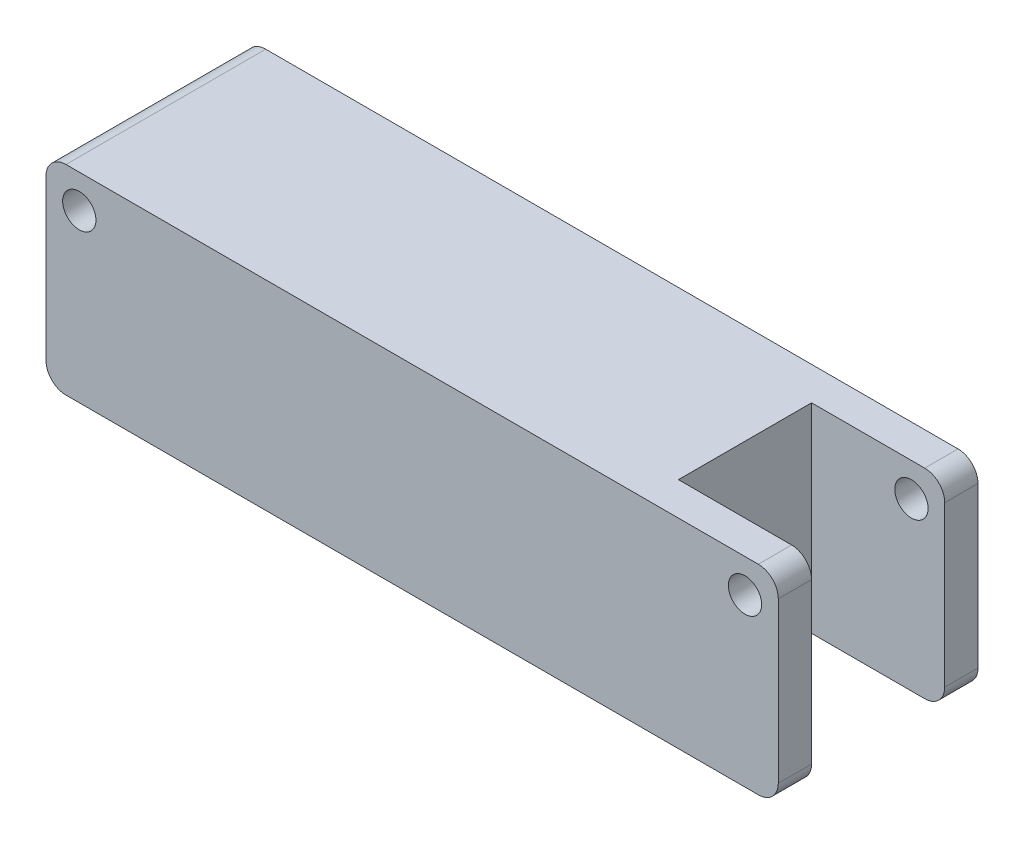
ISO-10303-21;
HEADER;
FILE_DESCRIPTION(('STEP AP214'),'2;1');
FILE_NAME('part.step','',(''),(''),'','','');
FILE_SCHEMA(('AUTOMOTIVE_DESIGN { 1 0 10303 214 1 1 1 1 }'));
ENDSEC;
DATA;
#1=APPLICATION_CONTEXT('core data for automotive mechanical design processes');
#2=APPLICATION_PROTOCOL_DEFINITION('international standard','automotive_design',2000,#1);
#3=PRODUCT_CONTEXT('',#1,'mechanical');
#4=PRODUCT('Part','Part','',(#3));
#5=PRODUCT_RELATED_PRODUCT_CATEGORY('part','',(#4));
#6=PRODUCT_DEFINITION_FORMATION('','',#4);
#7=PRODUCT_DEFINITION_CONTEXT('part definition',#1,'design');
#8=PRODUCT_DEFINITION('design','',#6,#7);
#9=PRODUCT_DEFINITION_SHAPE('','',#8);
#10=(LENGTH_UNIT() NAMED_UNIT(*) SI_UNIT(.MILLI.,.METRE.));
#11=(NAMED_UNIT(*) PLANE_ANGLE_UNIT() SI_UNIT($,.RADIAN.));
#12=(NAMED_UNIT(*) SI_UNIT($,.STERADIAN.) SOLID_ANGLE_UNIT());
#13=UNCERTAINTY_MEASURE_WITH_UNIT(LENGTH_MEASURE(1.E-05),#10,'distance_accuracy_value','');
#14=(GEOMETRIC_REPRESENTATION_CONTEXT(3) GLOBAL_UNCERTAINTY_ASSIGNED_CONTEXT((#13)) GLOBAL_UNIT_ASSIGNED_CONTEXT((#10,
#11,#12)) REPRESENTATION_CONTEXT('',''));
#15=CARTESIAN_POINT('',(0.,0.,0.));
#16=DIRECTION('',(0.,0.,1.));
#17=DIRECTION('',(1.,0.,0.));
#18=AXIS2_PLACEMENT_3D('',#15,#16,#17);
#19=CARTESIAN_POINT('',(110.,15.,15.));
#20=DIRECTION('',(-1.,0.,0.));
#21=DIRECTION('',(0.,0.,1.));
#22=AXIS2_PLACEMENT_3D('',#19,#20,#21);
#23=PLANE('',#22);
#24=DIRECTION('',(0.,0.,-1.));
#25=VECTOR('',#24,1.);
#26=CARTESIAN_POINT('',(110.,12.,15.));
#27=LINE('',#26,#25);
#28=CARTESIAN_POINT('',(110.,12.,-15.));
#29=VERTEX_POINT('',#28);
#30=CARTESIAN_POINT('',(110.,12.,-9.99999999999999));
#31=VERTEX_POINT('',#30);
#32=EDGE_CURVE('E226',#29,#31,#27,.F.);
#33=ORIENTED_EDGE('',*,*,#32,.T.);
#34=DIRECTION('',(0.,1.,0.));
#35=VECTOR('',#34,1.);
#36=CARTESIAN_POINT('',(110.,-15.,-9.99999999999999));
#37=LINE('',#36,#35);
#38=CARTESIAN_POINT('',(110.,-12.,-9.99999999999999));
#39=VERTEX_POINT('',#38);
#40=EDGE_CURVE('E174',#39,#31,#37,.T.);
#41=ORIENTED_EDGE('',*,*,#40,.F.);
#42=DIRECTION('',(0.,0.,-1.));
#43=VECTOR('',#42,1.);
#44=CARTESIAN_POINT('',(110.,-12.,-15.));
#45=LINE('',#44,#43);
#46=CARTESIAN_POINT('',(110.,-12.,-15.));
#47=VERTEX_POINT('',#46);
#48=EDGE_CURVE('E221',#39,#47,#45,.T.);
#49=ORIENTED_EDGE('',*,*,#48,.T.);
#50=DIRECTION('',(0.,-1.,0.));
#51=VECTOR('',#50,1.);
#52=CARTESIAN_POINT('',(110.,15.,-15.));
#53=LINE('',#52,#51);
#54=EDGE_CURVE('E197',#29,#47,#53,.T.);
#55=ORIENTED_EDGE('',*,*,#54,.F.);
#56=EDGE_LOOP('',(#33,#41,#49,#55));
#57=FACE_BOUND('',#56,.T.);
#58=ADVANCED_FACE('F36',(#57),#23,.F.);
#59=CARTESIAN_POINT('',(107.,12.,0.));
#60=DIRECTION('',(0.,0.,-1.));
#61=DIRECTION('',(-1.,0.,0.));
#62=AXIS2_PLACEMENT_3D('',#59,#60,#61);
#63=CYLINDRICAL_SURFACE('',#62,3.);
#64=CARTESIAN_POINT('',(107.,12.,-9.99999999999999));
#65=DIRECTION('',(0.,0.,-1.));
#66=DIRECTION('',(-1.,0.,0.));
#67=AXIS2_PLACEMENT_3D('',#64,#65,#66);
#68=CIRCLE('',#67,3.);
#69=CARTESIAN_POINT('',(107.,15.,-9.99999999999999));
#70=VERTEX_POINT('',#69);
#71=EDGE_CURVE('E180',#31,#70,#68,.F.);
#72=ORIENTED_EDGE('',*,*,#71,.F.);
#73=ORIENTED_EDGE('',*,*,#32,.F.);
#74=CARTESIAN_POINT('',(107.,12.,-15.));
#75=DIRECTION('',(0.,0.,1.));
#76=DIRECTION('',(1.,0.,0.));
#77=AXIS2_PLACEMENT_3D('',#74,#75,#76);
#78=CIRCLE('',#77,3.);
#79=CARTESIAN_POINT('',(107.,15.,-15.));
#80=VERTEX_POINT('',#79);
#81=EDGE_CURVE('E219',#80,#29,#78,.F.);
#82=ORIENTED_EDGE('',*,*,#81,.F.);
#83=DIRECTION('',(0.,0.,-1.));
#84=VECTOR('',#83,1.);
#85=CARTESIAN_POINT('',(107.,15.,0.));
#86=LINE('',#85,#84);
#87=EDGE_CURVE('E209',#70,#80,#86,.T.);
#88=ORIENTED_EDGE('',*,*,#87,.F.);
#89=EDGE_LOOP('',(#72,#73,#82,#88));
#90=FACE_BOUND('',#89,.T.);
#91=ADVANCED_FACE('F290',(#90),#63,.T.);
#92=CARTESIAN_POINT('',(107.,-12.,15.));
#93=DIRECTION('',(0.,0.,1.));
#94=DIRECTION('',(1.,0.,0.));
#95=AXIS2_PLACEMENT_3D('',#92,#93,#94);
#96=CYLINDRICAL_SURFACE('',#95,3.);
#97=CARTESIAN_POINT('',(107.,-12.,-9.99999999999999));
#98=DIRECTION('',(0.,0.,-1.));
#99=DIRECTION('',(-1.,0.,0.));
#100=AXIS2_PLACEMENT_3D('',#97,#98,#99);
#101=CIRCLE('',#100,3.);
#102=CARTESIAN_POINT('',(107.,-15.,-9.99999999999999));
#103=VERTEX_POINT('',#102);
#104=EDGE_CURVE('E11',#103,#39,#101,.F.);
#105=ORIENTED_EDGE('',*,*,#104,.F.);
#106=DIRECTION('',(0.,0.,-1.));
#107=VECTOR('',#106,1.);
#108=CARTESIAN_POINT('',(107.,-15.,15.));
#109=LINE('',#108,#107);
#110=CARTESIAN_POINT('',(107.,-15.,-15.));
#111=VERTEX_POINT('',#110);
#112=EDGE_CURVE('E162',#111,#103,#109,.F.);
#113=ORIENTED_EDGE('',*,*,#112,.F.);
#114=CARTESIAN_POINT('',(107.,-12.,-15.));
#115=DIRECTION('',(0.,0.,1.));
#116=DIRECTION('',(1.,0.,0.));
#117=AXIS2_PLACEMENT_3D('',#114,#115,#116);
#118=CIRCLE('',#117,3.);
#119=EDGE_CURVE('E217',#47,#111,#118,.F.);
#120=ORIENTED_EDGE('',*,*,#119,.F.);
#121=ORIENTED_EDGE('',*,*,#48,.F.);
#122=EDGE_LOOP('',(#105,#113,#120,#121));
#123=FACE_BOUND('',#122,.T.);
#124=ADVANCED_FACE('F281',(#123),#96,.T.);
#125=CARTESIAN_POINT('',(0.,15.,15.));
#126=DIRECTION('',(1.,0.,0.));
#127=DIRECTION('',(0.,0.,-1.));
#128=AXIS2_PLACEMENT_3D('',#125,#126,#127);
#129=PLANE('',#128);
#130=DIRECTION('',(0.,-1.,0.));
#131=VECTOR('',#130,1.);
#132=CARTESIAN_POINT('',(0.,15.,-15.));
#133=LINE('',#132,#131);
#134=CARTESIAN_POINT('',(0.,12.,-15.));
#135=VERTEX_POINT('',#134);
#136=CARTESIAN_POINT('',(0.,-12.,-15.));
#137=VERTEX_POINT('',#136);
#138=EDGE_CURVE('E190',#135,#137,#133,.T.);
#139=ORIENTED_EDGE('',*,*,#138,.T.);
#140=DIRECTION('',(0.,0.,1.));
#141=VECTOR('',#140,1.);
#142=CARTESIAN_POINT('',(0.,-12.,15.));
#143=LINE('',#142,#141);
#144=CARTESIAN_POINT('',(0.,-12.,15.));
#145=VERTEX_POINT('',#144);
#146=EDGE_CURVE('E242',#137,#145,#143,.T.);
#147=ORIENTED_EDGE('',*,*,#146,.T.);
#148=DIRECTION('',(0.,-1.,0.));
#149=VECTOR('',#148,1.);
#150=CARTESIAN_POINT('',(0.,15.,15.));
#151=LINE('',#150,#149);
#152=CARTESIAN_POINT('',(0.,12.,15.));
#153=VERTEX_POINT('',#152);
#154=EDGE_CURVE('E203',#153,#145,#151,.T.);
#155=ORIENTED_EDGE('',*,*,#154,.F.);
#156=DIRECTION('',(0.,0.,1.));
#157=VECTOR('',#156,1.);
#158=CARTESIAN_POINT('',(0.,12.,15.));
#159=LINE('',#158,#157);
#160=EDGE_CURVE('E240',#153,#135,#159,.F.);
#161=ORIENTED_EDGE('',*,*,#160,.T.);
#162=EDGE_LOOP('',(#139,#147,#155,#161));
#163=FACE_BOUND('',#162,.T.);
#164=ADVANCED_FACE('F273',(#163),#129,.F.);
#165=CARTESIAN_POINT('',(0.,15.,15.));
#166=DIRECTION('',(0.,0.,-1.));
#167=DIRECTION('',(-1.,0.,0.));
#168=AXIS2_PLACEMENT_3D('',#165,#166,#167);
#169=PLANE('',#168);
#170=CARTESIAN_POINT('',(105.,10.,15.));
#171=DIRECTION('',(0.,0.,-1.));
#172=DIRECTION('',(-1.,0.,0.));
#173=AXIS2_PLACEMENT_3D('',#170,#171,#172);
#174=CIRCLE('',#173,2.49999999999999);
#175=CARTESIAN_POINT('',(102.5,10.,15.));
#176=VERTEX_POINT('',#175);
#177=EDGE_CURVE('E415',#176,#176,#174,.T.);
#178=ORIENTED_EDGE('',*,*,#177,.T.);
#179=EDGE_LOOP('',(#178));
#180=FACE_BOUND('',#179,.T.);
#181=CARTESIAN_POINT('',(5.,10.,15.));
#182=DIRECTION('',(0.,0.,-1.));
#183=DIRECTION('',(1.,0.,0.));
#184=AXIS2_PLACEMENT_3D('',#181,#182,#183);
#185=CIRCLE('',#184,2.5);
#186=CARTESIAN_POINT('',(7.5,10.,15.));
#187=VERTEX_POINT('',#186);
#188=EDGE_CURVE('E422',#187,#187,#185,.T.);
#189=ORIENTED_EDGE('',*,*,#188,.T.);
#190=EDGE_LOOP('',(#189));
#191=FACE_BOUND('',#190,.T.);
#192=DIRECTION('',(0.,-1.,0.));
#193=VECTOR('',#192,1.);
#194=CARTESIAN_POINT('',(110.,15.,15.));
#195=LINE('',#194,#193);
#196=CARTESIAN_POINT('',(110.,12.,15.));
#197=VERTEX_POINT('',#196);
#198=CARTESIAN_POINT('',(110.,-12.,15.));
#199=VERTEX_POINT('',#198);
#200=EDGE_CURVE('E200',#197,#199,#195,.T.);
#201=ORIENTED_EDGE('',*,*,#200,.F.);
#202=CARTESIAN_POINT('',(107.,12.,15.));
#203=DIRECTION('',(0.,0.,-1.));
#204=DIRECTION('',(-1.,0.,0.));
#205=AXIS2_PLACEMENT_3D('',#202,#203,#204);
#206=CIRCLE('',#205,3.);
#207=CARTESIAN_POINT('',(107.,15.,15.));
#208=VERTEX_POINT('',#207);
#209=EDGE_CURVE('E234',#197,#208,#206,.F.);
#210=ORIENTED_EDGE('',*,*,#209,.T.);
#211=DIRECTION('',(1.,0.,0.));
#212=VECTOR('',#211,1.);
#213=CARTESIAN_POINT('',(0.,15.,15.));
#214=LINE('',#213,#212);
#215=CARTESIAN_POINT('',(3.,15.,15.));
#216=VERTEX_POINT('',#215);
#217=EDGE_CURVE('E183',#216,#208,#214,.T.);
#218=ORIENTED_EDGE('',*,*,#217,.F.);
#219=CARTESIAN_POINT('',(3.,12.,15.));
#220=DIRECTION('',(0.,0.,-1.));
#221=DIRECTION('',(-1.,0.,0.));
#222=AXIS2_PLACEMENT_3D('',#219,#220,#221);
#223=CIRCLE('',#222,3.);
#224=EDGE_CURVE('E229',#216,#153,#223,.F.);
#225=ORIENTED_EDGE('',*,*,#224,.T.);
#226=ORIENTED_EDGE('',*,*,#154,.T.);
#227=CARTESIAN_POINT('',(3.,-12.,15.));
#228=DIRECTION('',(0.,0.,-1.));
#229=DIRECTION('',(-1.,0.,0.));
#230=AXIS2_PLACEMENT_3D('',#227,#228,#229);
#231=CIRCLE('',#230,3.);
#232=CARTESIAN_POINT('',(3.,-15.,15.));
#233=VERTEX_POINT('',#232);
#234=EDGE_CURVE('E60',#145,#233,#231,.F.);
#235=ORIENTED_EDGE('',*,*,#234,.T.);
#236=DIRECTION('',(1.,0.,0.));
#237=VECTOR('',#236,1.);
#238=CARTESIAN_POINT('',(0.,-15.,15.));
#239=LINE('',#238,#237);
#240=CARTESIAN_POINT('',(107.,-15.,15.));
#241=VERTEX_POINT('',#240);
#242=EDGE_CURVE('E182',#233,#241,#239,.T.);
#243=ORIENTED_EDGE('',*,*,#242,.T.);
#244=CARTESIAN_POINT('',(107.,-12.,15.));
#245=DIRECTION('',(0.,0.,-1.));
#246=DIRECTION('',(-1.,0.,0.));
#247=AXIS2_PLACEMENT_3D('',#244,#245,#246);
#248=CIRCLE('',#247,3.);
#249=EDGE_CURVE('E232',#241,#199,#248,.F.);
#250=ORIENTED_EDGE('',*,*,#249,.T.);
#251=EDGE_LOOP('',(#201,#210,#218,#225,#226,#235,#243,#250));
#252=FACE_BOUND('',#251,.T.);
#253=ADVANCED_FACE('F253',(#180,#191,#252),#169,.F.);
#254=CARTESIAN_POINT('',(110.,-12.,9.99999999999999));
#255=VERTEX_POINT('',#254);
#256=EDGE_CURVE('E222',#199,#255,#45,.T.);
#257=ORIENTED_EDGE('',*,*,#256,.T.);
#258=DIRECTION('',(0.,1.,0.));
#259=VECTOR('',#258,1.);
#260=CARTESIAN_POINT('',(110.,-15.,9.99999999999999));
#261=LINE('',#260,#259);
#262=CARTESIAN_POINT('',(110.,12.,9.99999999999999));
#263=VERTEX_POINT('',#262);
#264=EDGE_CURVE('E52',#255,#263,#261,.T.);
#265=ORIENTED_EDGE('',*,*,#264,.T.);
#266=EDGE_CURVE('E225',#263,#197,#27,.F.);
#267=ORIENTED_EDGE('',*,*,#266,.T.);
#268=ORIENTED_EDGE('',*,*,#200,.T.);
#269=EDGE_LOOP('',(#257,#265,#267,#268));
#270=FACE_BOUND('',#269,.T.);
#271=ADVANCED_FACE('F256',(#270),#23,.F.);
#272=CARTESIAN_POINT('',(0.,15.,-15.));
#273=DIRECTION('',(0.,0.,1.));
#274=DIRECTION('',(1.,0.,0.));
#275=AXIS2_PLACEMENT_3D('',#272,#273,#274);
#276=PLANE('',#275);
#277=CARTESIAN_POINT('',(105.,10.,-15.));
#278=DIRECTION('',(0.,0.,-1.));
#279=DIRECTION('',(-1.,0.,0.));
#280=AXIS2_PLACEMENT_3D('',#277,#278,#279);
#281=CIRCLE('',#280,2.49999999999999);
#282=CARTESIAN_POINT('',(102.5,10.,-15.));
#283=VERTEX_POINT('',#282);
#284=EDGE_CURVE('E418',#283,#283,#281,.T.);
#285=ORIENTED_EDGE('',*,*,#284,.F.);
#286=EDGE_LOOP('',(#285));
#287=FACE_BOUND('',#286,.T.);
#288=CARTESIAN_POINT('',(5.,10.,-15.));
#289=DIRECTION('',(0.,0.,-1.));
#290=DIRECTION('',(1.,0.,0.));
#291=AXIS2_PLACEMENT_3D('',#288,#289,#290);
#292=CIRCLE('',#291,2.5);
#293=CARTESIAN_POINT('',(7.5,10.,-15.));
#294=VERTEX_POINT('',#293);
#295=EDGE_CURVE('E426',#294,#294,#292,.T.);
#296=ORIENTED_EDGE('',*,*,#295,.F.);
#297=EDGE_LOOP('',(#296));
#298=FACE_BOUND('',#297,.T.);
#299=DIRECTION('',(-1.,0.,0.));
#300=VECTOR('',#299,1.);
#301=CARTESIAN_POINT('',(0.,15.,-15.));
#302=LINE('',#301,#300);
#303=CARTESIAN_POINT('',(3.,15.,-15.));
#304=VERTEX_POINT('',#303);
#305=EDGE_CURVE('E186',#80,#304,#302,.T.);
#306=ORIENTED_EDGE('',*,*,#305,.F.);
#307=ORIENTED_EDGE('',*,*,#81,.T.);
#308=ORIENTED_EDGE('',*,*,#54,.T.);
#309=ORIENTED_EDGE('',*,*,#119,.T.);
#310=DIRECTION('',(-1.,0.,0.));
#311=VECTOR('',#310,1.);
#312=CARTESIAN_POINT('',(0.,-15.,-15.));
#313=LINE('',#312,#311);
#314=CARTESIAN_POINT('',(3.,-15.,-15.));
#315=VERTEX_POINT('',#314);
#316=EDGE_CURVE('E187',#111,#315,#313,.T.);
#317=ORIENTED_EDGE('',*,*,#316,.T.);
#318=CARTESIAN_POINT('',(3.,-12.,-15.));
#319=DIRECTION('',(0.,0.,1.));
#320=DIRECTION('',(1.,0.,0.));
#321=AXIS2_PLACEMENT_3D('',#318,#319,#320);
#322=CIRCLE('',#321,3.);
#323=EDGE_CURVE('E215',#315,#137,#322,.F.);
#324=ORIENTED_EDGE('',*,*,#323,.T.);
#325=ORIENTED_EDGE('',*,*,#138,.F.);
#326=CARTESIAN_POINT('',(3.,12.,-15.));
#327=DIRECTION('',(0.,0.,1.));
#328=DIRECTION('',(1.,0.,0.));
#329=AXIS2_PLACEMENT_3D('',#326,#327,#328);
#330=CIRCLE('',#329,3.);
#331=EDGE_CURVE('E213',#135,#304,#330,.F.);
#332=ORIENTED_EDGE('',*,*,#331,.T.);
#333=EDGE_LOOP('',(#306,#307,#308,#309,#317,#324,#325,#332));
#334=FACE_BOUND('',#333,.T.);
#335=ADVANCED_FACE('F278',(#287,#298,#334),#276,.F.);
#336=CARTESIAN_POINT('',(0.,15.,0.));
#337=DIRECTION('',(0.,-1.,0.));
#338=DIRECTION('',(0.,0.,-1.));
#339=AXIS2_PLACEMENT_3D('',#336,#337,#338);
#340=PLANE('',#339);
#341=DIRECTION('',(0.,0.,1.));
#342=VECTOR('',#341,1.);
#343=CARTESIAN_POINT('',(90.,15.,10.));
#344=LINE('',#343,#342);
#345=CARTESIAN_POINT('',(90.,15.,-10.));
#346=VERTEX_POINT('',#345);
#347=CARTESIAN_POINT('',(90.,15.,10.));
#348=VERTEX_POINT('',#347);
#349=EDGE_CURVE('E165',#346,#348,#344,.T.);
#350=ORIENTED_EDGE('',*,*,#349,.F.);
#351=DIRECTION('',(-1.,0.,0.));
#352=VECTOR('',#351,1.);
#353=CARTESIAN_POINT('',(90.,15.,-10.));
#354=LINE('',#353,#352);
#355=EDGE_CURVE('E144',#70,#346,#354,.T.);
#356=ORIENTED_EDGE('',*,*,#355,.F.);
#357=ORIENTED_EDGE('',*,*,#87,.T.);
#358=ORIENTED_EDGE('',*,*,#305,.T.);
#359=DIRECTION('',(0.,0.,1.));
#360=VECTOR('',#359,1.);
#361=CARTESIAN_POINT('',(3.,15.,0.));
#362=LINE('',#361,#360);
#363=EDGE_CURVE('E206',#304,#216,#362,.T.);
#364=ORIENTED_EDGE('',*,*,#363,.T.);
#365=ORIENTED_EDGE('',*,*,#217,.T.);
#366=CARTESIAN_POINT('',(107.,15.,9.99999999999999));
#367=VERTEX_POINT('',#366);
#368=EDGE_CURVE('E210',#208,#367,#86,.T.);
#369=ORIENTED_EDGE('',*,*,#368,.T.);
#370=DIRECTION('',(1.,0.,0.));
#371=VECTOR('',#370,1.);
#372=CARTESIAN_POINT('',(110.,15.,9.99999999999999));
#373=LINE('',#372,#371);
#374=EDGE_CURVE('E163',#348,#367,#373,.T.);
#375=ORIENTED_EDGE('',*,*,#374,.F.);
#376=EDGE_LOOP('',(#350,#356,#357,#358,#364,#365,#369,#375));
#377=FACE_BOUND('',#376,.T.);
#378=ADVANCED_FACE('F264',(#377),#340,.F.);
#379=CARTESIAN_POINT('',(0.,-15.,0.));
#380=DIRECTION('',(0.,-1.,0.));
#381=DIRECTION('',(0.,0.,-1.));
#382=AXIS2_PLACEMENT_3D('',#379,#380,#381);
#383=PLANE('',#382);
#384=DIRECTION('',(-1.,0.,0.));
#385=VECTOR('',#384,1.);
#386=CARTESIAN_POINT('',(90.,-15.,-10.));
#387=LINE('',#386,#385);
#388=CARTESIAN_POINT('',(90.,-15.,-10.));
#389=VERTEX_POINT('',#388);
#390=EDGE_CURVE('E141',#103,#389,#387,.T.);
#391=ORIENTED_EDGE('',*,*,#390,.T.);
#392=DIRECTION('',(0.,0.,1.));
#393=VECTOR('',#392,1.);
#394=CARTESIAN_POINT('',(90.,-15.,10.));
#395=LINE('',#394,#393);
#396=CARTESIAN_POINT('',(90.,-15.,10.));
#397=VERTEX_POINT('',#396);
#398=EDGE_CURVE('E152',#389,#397,#395,.T.);
#399=ORIENTED_EDGE('',*,*,#398,.T.);
#400=DIRECTION('',(1.,0.,0.));
#401=VECTOR('',#400,1.);
#402=CARTESIAN_POINT('',(110.,-15.,9.99999999999999));
#403=LINE('',#402,#401);
#404=CARTESIAN_POINT('',(107.,-15.,9.99999999999999));
#405=VERTEX_POINT('',#404);
#406=EDGE_CURVE('E149',#397,#405,#403,.T.);
#407=ORIENTED_EDGE('',*,*,#406,.T.);
#408=EDGE_CURVE('E238',#405,#241,#109,.F.);
#409=ORIENTED_EDGE('',*,*,#408,.T.);
#410=ORIENTED_EDGE('',*,*,#242,.F.);
#411=DIRECTION('',(0.,0.,1.));
#412=VECTOR('',#411,1.);
#413=CARTESIAN_POINT('',(3.,-15.,-15.));
#414=LINE('',#413,#412);
#415=EDGE_CURVE('E236',#233,#315,#414,.F.);
#416=ORIENTED_EDGE('',*,*,#415,.T.);
#417=ORIENTED_EDGE('',*,*,#316,.F.);
#418=ORIENTED_EDGE('',*,*,#112,.T.);
#419=EDGE_LOOP('',(#391,#399,#407,#409,#410,#416,#417,#418));
#420=FACE_BOUND('',#419,.T.);
#421=ADVANCED_FACE('F159',(#420),#383,.T.);
#422=CARTESIAN_POINT('',(107.,12.,9.99999999999999));
#423=DIRECTION('',(0.,0.,1.));
#424=DIRECTION('',(1.,0.,0.));
#425=AXIS2_PLACEMENT_3D('',#422,#423,#424);
#426=CIRCLE('',#425,3.);
#427=EDGE_CURVE('E176',#367,#263,#426,.F.);
#428=ORIENTED_EDGE('',*,*,#427,.F.);
#429=ORIENTED_EDGE('',*,*,#368,.F.);
#430=ORIENTED_EDGE('',*,*,#209,.F.);
#431=ORIENTED_EDGE('',*,*,#266,.F.);
#432=EDGE_LOOP('',(#428,#429,#430,#431));
#433=FACE_BOUND('',#432,.T.);
#434=ADVANCED_FACE('F260',(#433),#63,.T.);
#435=CARTESIAN_POINT('',(107.,-12.,9.99999999999999));
#436=DIRECTION('',(0.,0.,1.));
#437=DIRECTION('',(1.,0.,0.));
#438=AXIS2_PLACEMENT_3D('',#435,#436,#437);
#439=CIRCLE('',#438,3.);
#440=EDGE_CURVE('E45',#255,#405,#439,.F.);
#441=ORIENTED_EDGE('',*,*,#440,.F.);
#442=ORIENTED_EDGE('',*,*,#256,.F.);
#443=ORIENTED_EDGE('',*,*,#249,.F.);
#444=ORIENTED_EDGE('',*,*,#408,.F.);
#445=EDGE_LOOP('',(#441,#442,#443,#444));
#446=FACE_BOUND('',#445,.T.);
#447=ADVANCED_FACE('F250',(#446),#96,.T.);
#448=CARTESIAN_POINT('',(3.,-12.,15.));
#449=DIRECTION('',(0.,0.,-1.));
#450=DIRECTION('',(-1.,0.,0.));
#451=AXIS2_PLACEMENT_3D('',#448,#449,#450);
#452=CYLINDRICAL_SURFACE('',#451,3.);
#453=ORIENTED_EDGE('',*,*,#323,.F.);
#454=ORIENTED_EDGE('',*,*,#415,.F.);
#455=ORIENTED_EDGE('',*,*,#234,.F.);
#456=ORIENTED_EDGE('',*,*,#146,.F.);
#457=EDGE_LOOP('',(#453,#454,#455,#456));
#458=FACE_BOUND('',#457,.T.);
#459=ADVANCED_FACE('F276',(#458),#452,.T.);
#460=CARTESIAN_POINT('',(3.,12.,0.));
#461=DIRECTION('',(0.,0.,1.));
#462=DIRECTION('',(1.,0.,0.));
#463=AXIS2_PLACEMENT_3D('',#460,#461,#462);
#464=CYLINDRICAL_SURFACE('',#463,3.);
#465=ORIENTED_EDGE('',*,*,#331,.F.);
#466=ORIENTED_EDGE('',*,*,#160,.F.);
#467=ORIENTED_EDGE('',*,*,#224,.F.);
#468=ORIENTED_EDGE('',*,*,#363,.F.);
#469=EDGE_LOOP('',(#465,#466,#467,#468));
#470=FACE_BOUND('',#469,.T.);
#471=ADVANCED_FACE('F38',(#470),#464,.T.);
#472=CARTESIAN_POINT('',(90.,-15.,-10.));
#473=DIRECTION('',(0.,0.,-1.));
#474=DIRECTION('',(-1.,0.,0.));
#475=AXIS2_PLACEMENT_3D('',#472,#473,#474);
#476=PLANE('',#475);
#477=CARTESIAN_POINT('',(105.,10.,-9.99999999999999));
#478=DIRECTION('',(0.,0.,-1.));
#479=DIRECTION('',(-1.,0.,0.));
#480=AXIS2_PLACEMENT_3D('',#477,#478,#479);
#481=CIRCLE('',#480,2.49999999999999);
#482=CARTESIAN_POINT('',(102.5,10.,-9.99999999999999));
#483=VERTEX_POINT('',#482);
#484=EDGE_CURVE('E168',#483,#483,#481,.T.);
#485=ORIENTED_EDGE('',*,*,#484,.T.);
#486=EDGE_LOOP('',(#485));
#487=FACE_BOUND('',#486,.T.);
#488=ORIENTED_EDGE('',*,*,#71,.T.);
#489=ORIENTED_EDGE('',*,*,#355,.T.);
#490=DIRECTION('',(0.,1.,0.));
#491=VECTOR('',#490,1.);
#492=CARTESIAN_POINT('',(90.,-15.,-10.));
#493=LINE('',#492,#491);
#494=EDGE_CURVE('E137',#389,#346,#493,.T.);
#495=ORIENTED_EDGE('',*,*,#494,.F.);
#496=ORIENTED_EDGE('',*,*,#390,.F.);
#497=ORIENTED_EDGE('',*,*,#104,.T.);
#498=ORIENTED_EDGE('',*,*,#40,.T.);
#499=EDGE_LOOP('',(#488,#489,#495,#496,#497,#498));
#500=FACE_BOUND('',#499,.T.);
#501=ADVANCED_FACE('F139',(#487,#500),#476,.F.);
#502=CARTESIAN_POINT('',(110.,-15.,9.99999999999999));
#503=DIRECTION('',(0.,0.,1.));
#504=DIRECTION('',(1.,0.,0.));
#505=AXIS2_PLACEMENT_3D('',#502,#503,#504);
#506=PLANE('',#505);
#507=CARTESIAN_POINT('',(105.,10.,9.99999999999999));
#508=DIRECTION('',(0.,0.,1.));
#509=DIRECTION('',(1.,0.,0.));
#510=AXIS2_PLACEMENT_3D('',#507,#508,#509);
#511=CIRCLE('',#510,2.49999999999999);
#512=CARTESIAN_POINT('',(107.5,10.,9.99999999999999));
#513=VERTEX_POINT('',#512);
#514=EDGE_CURVE('E40',#513,#513,#511,.T.);
#515=ORIENTED_EDGE('',*,*,#514,.T.);
#516=EDGE_LOOP('',(#515));
#517=FACE_BOUND('',#516,.T.);
#518=ORIENTED_EDGE('',*,*,#427,.T.);
#519=ORIENTED_EDGE('',*,*,#264,.F.);
#520=ORIENTED_EDGE('',*,*,#440,.T.);
#521=ORIENTED_EDGE('',*,*,#406,.F.);
#522=DIRECTION('',(0.,1.,0.));
#523=VECTOR('',#522,1.);
#524=CARTESIAN_POINT('',(90.,-15.,10.));
#525=LINE('',#524,#523);
#526=EDGE_CURVE('E148',#397,#348,#525,.T.);
#527=ORIENTED_EDGE('',*,*,#526,.T.);
#528=ORIENTED_EDGE('',*,*,#374,.T.);
#529=EDGE_LOOP('',(#518,#519,#520,#521,#527,#528));
#530=FACE_BOUND('',#529,.T.);
#531=ADVANCED_FACE('F244',(#517,#530),#506,.F.);
#532=CARTESIAN_POINT('',(90.,-15.,10.));
#533=DIRECTION('',(-1.,0.,0.));
#534=DIRECTION('',(0.,0.,1.));
#535=AXIS2_PLACEMENT_3D('',#532,#533,#534);
#536=PLANE('',#535);
#537=ORIENTED_EDGE('',*,*,#349,.T.);
#538=ORIENTED_EDGE('',*,*,#526,.F.);
#539=ORIENTED_EDGE('',*,*,#398,.F.);
#540=ORIENTED_EDGE('',*,*,#494,.T.);
#541=EDGE_LOOP('',(#537,#538,#539,#540));
#542=FACE_BOUND('',#541,.T.);
#543=ADVANCED_FACE('F153',(#542),#536,.F.);
#544=CARTESIAN_POINT('',(105.,10.,15.));
#545=DIRECTION('',(0.,0.,-1.));
#546=DIRECTION('',(-1.,0.,0.));
#547=AXIS2_PLACEMENT_3D('',#544,#545,#546);
#548=CYLINDRICAL_SURFACE('',#547,2.49999999999999);
#549=ORIENTED_EDGE('',*,*,#177,.F.);
#550=EDGE_LOOP('',(#549));
#551=FACE_BOUND('',#550,.T.);
#552=ORIENTED_EDGE('',*,*,#514,.F.);
#553=EDGE_LOOP('',(#552));
#554=FACE_BOUND('',#553,.T.);
#555=ADVANCED_FACE('F366',(#551,#554),#548,.F.);
#556=ORIENTED_EDGE('',*,*,#284,.T.);
#557=EDGE_LOOP('',(#556));
#558=FACE_BOUND('',#557,.T.);
#559=ORIENTED_EDGE('',*,*,#484,.F.);
#560=EDGE_LOOP('',(#559));
#561=FACE_BOUND('',#560,.T.);
#562=ADVANCED_FACE('F381',(#558,#561),#548,.F.);
#563=CARTESIAN_POINT('',(5.,10.,15.));
#564=DIRECTION('',(0.,0.,-1.));
#565=DIRECTION('',(-1.,0.,0.));
#566=AXIS2_PLACEMENT_3D('',#563,#564,#565);
#567=CYLINDRICAL_SURFACE('',#566,2.5);
#568=ORIENTED_EDGE('',*,*,#188,.F.);
#569=EDGE_LOOP('',(#568));
#570=FACE_BOUND('',#569,.T.);
#571=ORIENTED_EDGE('',*,*,#295,.T.);
#572=EDGE_LOOP('',(#571));
#573=FACE_BOUND('',#572,.T.);
#574=ADVANCED_FACE('F388',(#570,#573),#567,.F.);
#575=CLOSED_SHELL('',(#58,#91,#124,#164,#253,#271,#335,#378,#421,#434,#447,#459,#471,#501,#531,
#543,#555,#562,#574));
#576=MANIFOLD_SOLID_BREP('B2',#575);
#577=ADVANCED_BREP_SHAPE_REPRESENTATION('',(#18,#576),#14);
#578=SHAPE_DEFINITION_REPRESENTATION(#9,#577);
ENDSEC;
END-ISO-10303-21;
